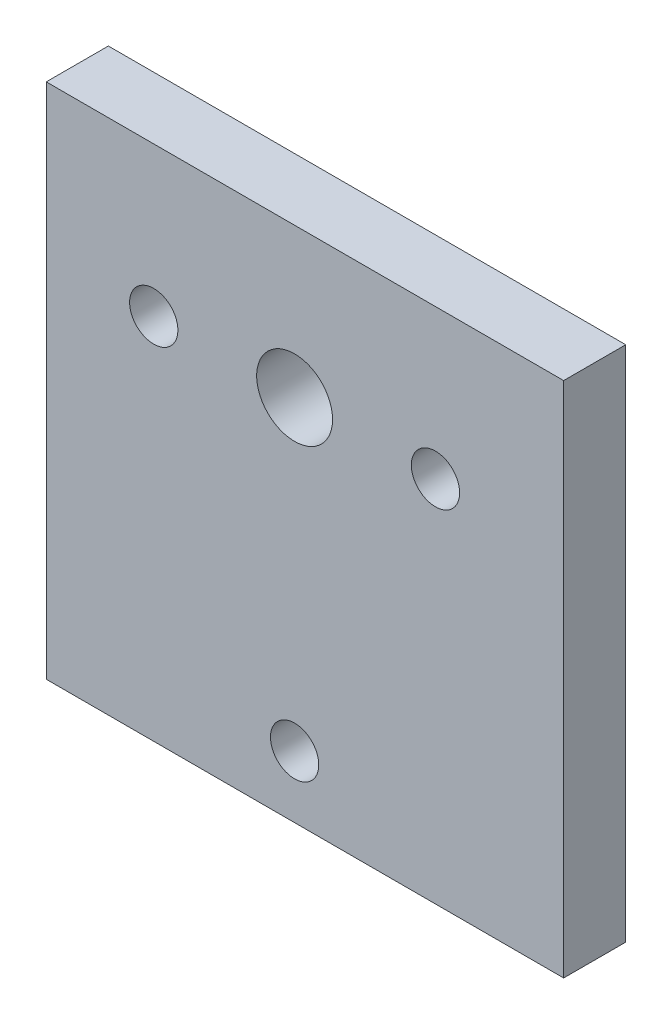
ISO-10303-21;
HEADER;
FILE_DESCRIPTION(('STEP AP214'),'2;1');
FILE_NAME('part.step','',(''),(''),'','','');
FILE_SCHEMA(('AUTOMOTIVE_DESIGN { 1 0 10303 214 1 1 1 1 }'));
ENDSEC;
DATA;
#1=APPLICATION_CONTEXT('core data for automotive mechanical design processes');
#2=APPLICATION_PROTOCOL_DEFINITION('international standard','automotive_design',2000,#1);
#3=PRODUCT_CONTEXT('',#1,'mechanical');
#4=PRODUCT('Part','Part','',(#3));
#5=PRODUCT_RELATED_PRODUCT_CATEGORY('part','',(#4));
#6=PRODUCT_DEFINITION_FORMATION('','',#4);
#7=PRODUCT_DEFINITION_CONTEXT('part definition',#1,'design');
#8=PRODUCT_DEFINITION('design','',#6,#7);
#9=PRODUCT_DEFINITION_SHAPE('','',#8);
#10=(LENGTH_UNIT() NAMED_UNIT(*) SI_UNIT(.MILLI.,.METRE.));
#11=(NAMED_UNIT(*) PLANE_ANGLE_UNIT() SI_UNIT($,.RADIAN.));
#12=(NAMED_UNIT(*) SI_UNIT($,.STERADIAN.) SOLID_ANGLE_UNIT());
#13=UNCERTAINTY_MEASURE_WITH_UNIT(LENGTH_MEASURE(1.E-05),#10,'distance_accuracy_value','');
#14=(GEOMETRIC_REPRESENTATION_CONTEXT(3) GLOBAL_UNCERTAINTY_ASSIGNED_CONTEXT((#13)) GLOBAL_UNIT_ASSIGNED_CONTEXT((#10,
#11,#12)) REPRESENTATION_CONTEXT('',''));
#15=CARTESIAN_POINT('',(0.,0.,0.));
#16=DIRECTION('',(0.,0.,1.));
#17=DIRECTION('',(1.,0.,0.));
#18=AXIS2_PLACEMENT_3D('',#15,#16,#17);
#19=CARTESIAN_POINT('',(0.,0.,4.5));
#20=DIRECTION('',(0.,0.,1.));
#21=DIRECTION('',(1.,0.,0.));
#22=AXIS2_PLACEMENT_3D('',#19,#20,#21);
#23=PLANE('',#22);
#24=CARTESIAN_POINT('',(-10.96,7.92918,4.5));
#25=DIRECTION('',(0.,0.,1.));
#26=DIRECTION('',(1.,0.,0.));
#27=AXIS2_PLACEMENT_3D('',#24,#25,#26);
#28=CIRCLE('',#27,1.75);
#29=CARTESIAN_POINT('',(-9.21,7.92918,4.5));
#30=VERTEX_POINT('',#29);
#31=EDGE_CURVE('E116',#30,#30,#28,.T.);
#32=ORIENTED_EDGE('',*,*,#31,.F.);
#33=EDGE_LOOP('',(#32));
#34=FACE_BOUND('',#33,.T.);
#35=CARTESIAN_POINT('',(-0.750000000000004,7.92918,4.5));
#36=DIRECTION('',(0.,0.,1.));
#37=DIRECTION('',(1.,0.,0.));
#38=AXIS2_PLACEMENT_3D('',#35,#36,#37);
#39=CIRCLE('',#38,2.75);
#40=CARTESIAN_POINT('',(2.,7.92918,4.5));
#41=VERTEX_POINT('',#40);
#42=EDGE_CURVE('E117',#41,#41,#39,.T.);
#43=ORIENTED_EDGE('',*,*,#42,.F.);
#44=EDGE_LOOP('',(#43));
#45=FACE_BOUND('',#44,.T.);
#46=DIRECTION('',(0.,1.,0.));
#47=VECTOR('',#46,1.);
#48=CARTESIAN_POINT('',(18.75,18.75,4.5));
#49=LINE('',#48,#47);
#50=CARTESIAN_POINT('',(18.75,-18.75,4.5));
#51=VERTEX_POINT('',#50);
#52=CARTESIAN_POINT('',(18.75,18.75,4.5));
#53=VERTEX_POINT('',#52);
#54=EDGE_CURVE('E85',#51,#53,#49,.T.);
#55=ORIENTED_EDGE('',*,*,#54,.T.);
#56=DIRECTION('',(-1.,0.,0.));
#57=VECTOR('',#56,1.);
#58=CARTESIAN_POINT('',(18.75,18.75,4.5));
#59=LINE('',#58,#57);
#60=CARTESIAN_POINT('',(-18.75,18.75,4.5));
#61=VERTEX_POINT('',#60);
#62=EDGE_CURVE('E80',#53,#61,#59,.T.);
#63=ORIENTED_EDGE('',*,*,#62,.T.);
#64=DIRECTION('',(0.,-1.,0.));
#65=VECTOR('',#64,1.);
#66=CARTESIAN_POINT('',(-18.75,18.75,4.5));
#67=LINE('',#66,#65);
#68=CARTESIAN_POINT('',(-18.75,-18.75,4.5));
#69=VERTEX_POINT('',#68);
#70=EDGE_CURVE('E83',#61,#69,#67,.T.);
#71=ORIENTED_EDGE('',*,*,#70,.T.);
#72=DIRECTION('',(1.,0.,0.));
#73=VECTOR('',#72,1.);
#74=CARTESIAN_POINT('',(-18.75,-18.75,4.5));
#75=LINE('',#74,#73);
#76=EDGE_CURVE('E50',#69,#51,#75,.T.);
#77=ORIENTED_EDGE('',*,*,#76,.T.);
#78=EDGE_LOOP('',(#55,#63,#71,#77));
#79=FACE_BOUND('',#78,.T.);
#80=CARTESIAN_POINT('',(9.46,7.92918,4.5));
#81=DIRECTION('',(0.,0.,1.));
#82=DIRECTION('',(1.,0.,0.));
#83=AXIS2_PLACEMENT_3D('',#80,#81,#82);
#84=CIRCLE('',#83,1.75);
#85=CARTESIAN_POINT('',(11.21,7.92918,4.5));
#86=VERTEX_POINT('',#85);
#87=EDGE_CURVE('E105',#86,#86,#84,.T.);
#88=ORIENTED_EDGE('',*,*,#87,.F.);
#89=EDGE_LOOP('',(#88));
#90=FACE_BOUND('',#89,.T.);
#91=CARTESIAN_POINT('',(-0.750000000000018,-14.25,4.5));
#92=DIRECTION('',(0.,0.,1.));
#93=DIRECTION('',(1.,0.,0.));
#94=AXIS2_PLACEMENT_3D('',#91,#92,#93);
#95=CIRCLE('',#94,1.75);
#96=CARTESIAN_POINT('',(0.999999999999982,-14.25,4.5));
#97=VERTEX_POINT('',#96);
#98=EDGE_CURVE('E230',#97,#97,#95,.T.);
#99=ORIENTED_EDGE('',*,*,#98,.F.);
#100=EDGE_LOOP('',(#99));
#101=FACE_BOUND('',#100,.T.);
#102=ADVANCED_FACE('F33',(#34,#45,#79,#90,#101),#23,.T.);
#103=CARTESIAN_POINT('',(0.,0.,0.));
#104=DIRECTION('',(0.,0.,1.));
#105=DIRECTION('',(1.,0.,0.));
#106=AXIS2_PLACEMENT_3D('',#103,#104,#105);
#107=PLANE('',#106);
#108=CARTESIAN_POINT('',(-10.96,7.92918,0.));
#109=DIRECTION('',(0.,0.,1.));
#110=DIRECTION('',(1.,0.,0.));
#111=AXIS2_PLACEMENT_3D('',#108,#109,#110);
#112=CIRCLE('',#111,1.75);
#113=CARTESIAN_POINT('',(-9.21,7.92918,0.));
#114=VERTEX_POINT('',#113);
#115=EDGE_CURVE('E112',#114,#114,#112,.T.);
#116=ORIENTED_EDGE('',*,*,#115,.T.);
#117=EDGE_LOOP('',(#116));
#118=FACE_BOUND('',#117,.T.);
#119=CARTESIAN_POINT('',(-0.750000000000004,7.92918,0.));
#120=DIRECTION('',(0.,0.,1.));
#121=DIRECTION('',(1.,0.,0.));
#122=AXIS2_PLACEMENT_3D('',#119,#120,#121);
#123=CIRCLE('',#122,2.75);
#124=CARTESIAN_POINT('',(2.,7.92918,0.));
#125=VERTEX_POINT('',#124);
#126=EDGE_CURVE('E110',#125,#125,#123,.T.);
#127=ORIENTED_EDGE('',*,*,#126,.T.);
#128=EDGE_LOOP('',(#127));
#129=FACE_BOUND('',#128,.T.);
#130=DIRECTION('',(0.,1.,0.));
#131=VECTOR('',#130,1.);
#132=CARTESIAN_POINT('',(18.75,18.75,0.));
#133=LINE('',#132,#131);
#134=CARTESIAN_POINT('',(18.75,-18.75,0.));
#135=VERTEX_POINT('',#134);
#136=CARTESIAN_POINT('',(18.75,18.75,0.));
#137=VERTEX_POINT('',#136);
#138=EDGE_CURVE('E121',#135,#137,#133,.T.);
#139=ORIENTED_EDGE('',*,*,#138,.F.);
#140=DIRECTION('',(1.,0.,0.));
#141=VECTOR('',#140,1.);
#142=CARTESIAN_POINT('',(-18.75,-18.75,0.));
#143=LINE('',#142,#141);
#144=CARTESIAN_POINT('',(-18.75,-18.75,0.));
#145=VERTEX_POINT('',#144);
#146=EDGE_CURVE('E73',#145,#135,#143,.T.);
#147=ORIENTED_EDGE('',*,*,#146,.F.);
#148=DIRECTION('',(0.,-1.,0.));
#149=VECTOR('',#148,1.);
#150=CARTESIAN_POINT('',(-18.75,18.75,0.));
#151=LINE('',#150,#149);
#152=CARTESIAN_POINT('',(-18.75,18.75,0.));
#153=VERTEX_POINT('',#152);
#154=EDGE_CURVE('E67',#153,#145,#151,.T.);
#155=ORIENTED_EDGE('',*,*,#154,.F.);
#156=DIRECTION('',(-1.,0.,0.));
#157=VECTOR('',#156,1.);
#158=CARTESIAN_POINT('',(18.75,18.75,0.));
#159=LINE('',#158,#157);
#160=EDGE_CURVE('E89',#137,#153,#159,.T.);
#161=ORIENTED_EDGE('',*,*,#160,.F.);
#162=EDGE_LOOP('',(#139,#147,#155,#161));
#163=FACE_BOUND('',#162,.T.);
#164=CARTESIAN_POINT('',(9.46,7.92918,0.));
#165=DIRECTION('',(0.,0.,1.));
#166=DIRECTION('',(1.,0.,0.));
#167=AXIS2_PLACEMENT_3D('',#164,#165,#166);
#168=CIRCLE('',#167,1.75);
#169=CARTESIAN_POINT('',(11.21,7.92918,0.));
#170=VERTEX_POINT('',#169);
#171=EDGE_CURVE('E111',#170,#170,#168,.T.);
#172=ORIENTED_EDGE('',*,*,#171,.T.);
#173=EDGE_LOOP('',(#172));
#174=FACE_BOUND('',#173,.T.);
#175=CARTESIAN_POINT('',(-0.750000000000018,-14.25,0.));
#176=DIRECTION('',(0.,0.,1.));
#177=DIRECTION('',(1.,0.,0.));
#178=AXIS2_PLACEMENT_3D('',#175,#176,#177);
#179=CIRCLE('',#178,1.75);
#180=CARTESIAN_POINT('',(0.999999999999982,-14.25,0.));
#181=VERTEX_POINT('',#180);
#182=EDGE_CURVE('E233',#181,#181,#179,.T.);
#183=ORIENTED_EDGE('',*,*,#182,.T.);
#184=EDGE_LOOP('',(#183));
#185=FACE_BOUND('',#184,.T.);
#186=ADVANCED_FACE('F133',(#118,#129,#163,#174,#185),#107,.F.);
#187=CARTESIAN_POINT('',(18.75,18.75,4.5));
#188=DIRECTION('',(-1.,0.,0.));
#189=DIRECTION('',(0.,-1.,0.));
#190=AXIS2_PLACEMENT_3D('',#187,#188,#189);
#191=PLANE('',#190);
#192=ORIENTED_EDGE('',*,*,#138,.T.);
#193=DIRECTION('',(0.,0.,-1.));
#194=VECTOR('',#193,1.);
#195=CARTESIAN_POINT('',(18.75,18.75,4.5));
#196=LINE('',#195,#194);
#197=EDGE_CURVE('E12',#53,#137,#196,.T.);
#198=ORIENTED_EDGE('',*,*,#197,.F.);
#199=ORIENTED_EDGE('',*,*,#54,.F.);
#200=DIRECTION('',(0.,0.,-1.));
#201=VECTOR('',#200,1.);
#202=CARTESIAN_POINT('',(18.75,-18.75,4.5));
#203=LINE('',#202,#201);
#204=EDGE_CURVE('E93',#51,#135,#203,.T.);
#205=ORIENTED_EDGE('',*,*,#204,.T.);
#206=EDGE_LOOP('',(#192,#198,#199,#205));
#207=FACE_BOUND('',#206,.T.);
#208=ADVANCED_FACE('F35',(#207),#191,.F.);
#209=CARTESIAN_POINT('',(18.75,18.75,4.5));
#210=DIRECTION('',(0.,-1.,0.));
#211=DIRECTION('',(1.,0.,0.));
#212=AXIS2_PLACEMENT_3D('',#209,#210,#211);
#213=PLANE('',#212);
#214=ORIENTED_EDGE('',*,*,#160,.T.);
#215=DIRECTION('',(0.,0.,-1.));
#216=VECTOR('',#215,1.);
#217=CARTESIAN_POINT('',(-18.75,18.75,4.5));
#218=LINE('',#217,#216);
#219=EDGE_CURVE('E42',#61,#153,#218,.T.);
#220=ORIENTED_EDGE('',*,*,#219,.F.);
#221=ORIENTED_EDGE('',*,*,#62,.F.);
#222=ORIENTED_EDGE('',*,*,#197,.T.);
#223=EDGE_LOOP('',(#214,#220,#221,#222));
#224=FACE_BOUND('',#223,.T.);
#225=ADVANCED_FACE('F88',(#224),#213,.F.);
#226=CARTESIAN_POINT('',(-18.75,18.75,4.5));
#227=DIRECTION('',(1.,0.,0.));
#228=DIRECTION('',(0.,0.,-1.));
#229=AXIS2_PLACEMENT_3D('',#226,#227,#228);
#230=PLANE('',#229);
#231=ORIENTED_EDGE('',*,*,#154,.T.);
#232=DIRECTION('',(0.,0.,-1.));
#233=VECTOR('',#232,1.);
#234=CARTESIAN_POINT('',(-18.75,-18.75,4.5));
#235=LINE('',#234,#233);
#236=EDGE_CURVE('E90',#69,#145,#235,.T.);
#237=ORIENTED_EDGE('',*,*,#236,.F.);
#238=ORIENTED_EDGE('',*,*,#70,.F.);
#239=ORIENTED_EDGE('',*,*,#219,.T.);
#240=EDGE_LOOP('',(#231,#237,#238,#239));
#241=FACE_BOUND('',#240,.T.);
#242=ADVANCED_FACE('F91',(#241),#230,.F.);
#243=CARTESIAN_POINT('',(-18.75,-18.75,4.5));
#244=DIRECTION('',(0.,1.,0.));
#245=DIRECTION('',(0.,0.,1.));
#246=AXIS2_PLACEMENT_3D('',#243,#244,#245);
#247=PLANE('',#246);
#248=ORIENTED_EDGE('',*,*,#146,.T.);
#249=ORIENTED_EDGE('',*,*,#204,.F.);
#250=ORIENTED_EDGE('',*,*,#76,.F.);
#251=ORIENTED_EDGE('',*,*,#236,.T.);
#252=EDGE_LOOP('',(#248,#249,#250,#251));
#253=FACE_BOUND('',#252,.T.);
#254=ADVANCED_FACE('F130',(#253),#247,.F.);
#255=CARTESIAN_POINT('',(-0.750000000000004,7.92918,4.5));
#256=DIRECTION('',(0.,0.,-1.));
#257=DIRECTION('',(-1.,0.,0.));
#258=AXIS2_PLACEMENT_3D('',#255,#256,#257);
#259=CYLINDRICAL_SURFACE('',#258,2.75);
#260=ORIENTED_EDGE('',*,*,#42,.T.);
#261=EDGE_LOOP('',(#260));
#262=FACE_BOUND('',#261,.T.);
#263=ORIENTED_EDGE('',*,*,#126,.F.);
#264=EDGE_LOOP('',(#263));
#265=FACE_BOUND('',#264,.T.);
#266=ADVANCED_FACE('F152',(#262,#265),#259,.F.);
#267=CARTESIAN_POINT('',(9.46,7.92918,4.5));
#268=DIRECTION('',(0.,0.,-1.));
#269=DIRECTION('',(-1.,0.,0.));
#270=AXIS2_PLACEMENT_3D('',#267,#268,#269);
#271=CYLINDRICAL_SURFACE('',#270,1.75);
#272=ORIENTED_EDGE('',*,*,#87,.T.);
#273=EDGE_LOOP('',(#272));
#274=FACE_BOUND('',#273,.T.);
#275=ORIENTED_EDGE('',*,*,#171,.F.);
#276=EDGE_LOOP('',(#275));
#277=FACE_BOUND('',#276,.T.);
#278=ADVANCED_FACE('F172',(#274,#277),#271,.F.);
#279=CARTESIAN_POINT('',(-10.96,7.92918,4.5));
#280=DIRECTION('',(0.,0.,-1.));
#281=DIRECTION('',(-1.,0.,0.));
#282=AXIS2_PLACEMENT_3D('',#279,#280,#281);
#283=CYLINDRICAL_SURFACE('',#282,1.75);
#284=ORIENTED_EDGE('',*,*,#31,.T.);
#285=EDGE_LOOP('',(#284));
#286=FACE_BOUND('',#285,.T.);
#287=ORIENTED_EDGE('',*,*,#115,.F.);
#288=EDGE_LOOP('',(#287));
#289=FACE_BOUND('',#288,.T.);
#290=ADVANCED_FACE('F179',(#286,#289),#283,.F.);
#291=CARTESIAN_POINT('',(-0.750000000000018,-14.25,4.5));
#292=DIRECTION('',(0.,0.,-1.));
#293=DIRECTION('',(-1.,0.,0.));
#294=AXIS2_PLACEMENT_3D('',#291,#292,#293);
#295=CYLINDRICAL_SURFACE('',#294,1.75);
#296=ORIENTED_EDGE('',*,*,#98,.T.);
#297=EDGE_LOOP('',(#296));
#298=FACE_BOUND('',#297,.T.);
#299=ORIENTED_EDGE('',*,*,#182,.F.);
#300=EDGE_LOOP('',(#299));
#301=FACE_BOUND('',#300,.T.);
#302=ADVANCED_FACE('F186',(#298,#301),#295,.F.);
#303=CLOSED_SHELL('',(#102,#186,#208,#225,#242,#254,#266,#278,#290,#302));
#304=MANIFOLD_SOLID_BREP('B2',#303);
#305=ADVANCED_BREP_SHAPE_REPRESENTATION('',(#18,#304),#14);
#306=SHAPE_DEFINITION_REPRESENTATION(#9,#305);
ENDSEC;
END-ISO-10303-21;
